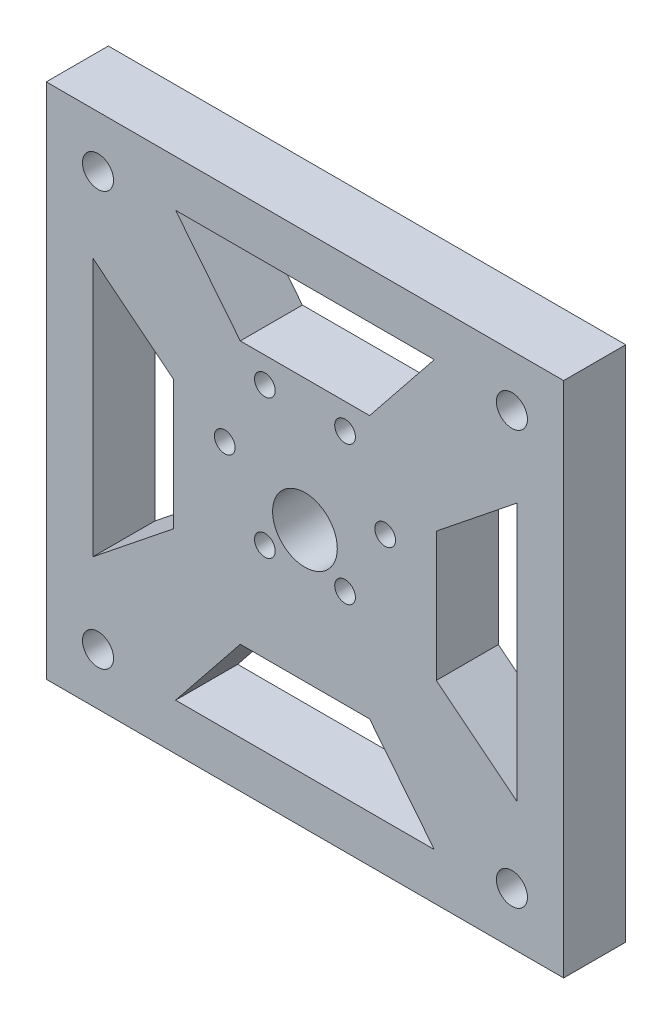
ISO-10303-21;
HEADER;
FILE_DESCRIPTION(('STEP AP214'),'2;1');
FILE_NAME('part.step','',(''),(''),'','','');
FILE_SCHEMA(('AUTOMOTIVE_DESIGN { 1 0 10303 214 1 1 1 1 }'));
ENDSEC;
DATA;
#1=APPLICATION_CONTEXT('core data for automotive mechanical design processes');
#2=APPLICATION_PROTOCOL_DEFINITION('international standard','automotive_design',2000,#1);
#3=PRODUCT_CONTEXT('',#1,'mechanical');
#4=PRODUCT('Part','Part','',(#3));
#5=PRODUCT_RELATED_PRODUCT_CATEGORY('part','',(#4));
#6=PRODUCT_DEFINITION_FORMATION('','',#4);
#7=PRODUCT_DEFINITION_CONTEXT('part definition',#1,'design');
#8=PRODUCT_DEFINITION('design','',#6,#7);
#9=PRODUCT_DEFINITION_SHAPE('','',#8);
#10=(LENGTH_UNIT() NAMED_UNIT(*) SI_UNIT(.MILLI.,.METRE.));
#11=(NAMED_UNIT(*) PLANE_ANGLE_UNIT() SI_UNIT($,.RADIAN.));
#12=(NAMED_UNIT(*) SI_UNIT($,.STERADIAN.) SOLID_ANGLE_UNIT());
#13=UNCERTAINTY_MEASURE_WITH_UNIT(LENGTH_MEASURE(1.E-05),#10,'distance_accuracy_value','');
#14=(GEOMETRIC_REPRESENTATION_CONTEXT(3) GLOBAL_UNCERTAINTY_ASSIGNED_CONTEXT((#13)) GLOBAL_UNIT_ASSIGNED_CONTEXT((#10,
#11,#12)) REPRESENTATION_CONTEXT('',''));
#15=CARTESIAN_POINT('',(0.,0.,0.));
#16=DIRECTION('',(0.,0.,1.));
#17=DIRECTION('',(1.,0.,0.));
#18=AXIS2_PLACEMENT_3D('',#15,#16,#17);
#19=CARTESIAN_POINT('',(0.,0.,12.));
#20=DIRECTION('',(0.,0.,1.));
#21=DIRECTION('',(1.,0.,0.));
#22=AXIS2_PLACEMENT_3D('',#19,#20,#21);
#23=PLANE('',#22);
#24=DIRECTION('',(-0.7806247497998,0.625,0.));
#25=VECTOR('',#24,1.);
#26=CARTESIAN_POINT('',(-25.387505004004,5.5,12.));
#27=LINE('',#26,#25);
#28=CARTESIAN_POINT('',(-25.387505004004,5.5,12.));
#29=VERTEX_POINT('',#28);
#30=CARTESIAN_POINT('',(-41.,18.,12.));
#31=VERTEX_POINT('',#30);
#32=EDGE_CURVE('E64',#29,#31,#27,.T.);
#33=ORIENTED_EDGE('',*,*,#32,.F.);
#34=DIRECTION('',(0.,1.,0.));
#35=VECTOR('',#34,1.);
#36=CARTESIAN_POINT('',(-25.387505004004,-19.5,12.));
#37=LINE('',#36,#35);
#38=CARTESIAN_POINT('',(-25.387505004004,-19.5,12.));
#39=VERTEX_POINT('',#38);
#40=EDGE_CURVE('E206',#39,#29,#37,.T.);
#41=ORIENTED_EDGE('',*,*,#40,.F.);
#42=DIRECTION('',(0.780624749799799,0.625,0.));
#43=VECTOR('',#42,1.);
#44=CARTESIAN_POINT('',(-41.,-32.,12.));
#45=LINE('',#44,#43);
#46=CARTESIAN_POINT('',(-41.,-32.,12.));
#47=VERTEX_POINT('',#46);
#48=EDGE_CURVE('E209',#47,#39,#45,.T.);
#49=ORIENTED_EDGE('',*,*,#48,.F.);
#50=DIRECTION('',(0.,-1.,0.));
#51=VECTOR('',#50,1.);
#52=CARTESIAN_POINT('',(-41.,18.,12.));
#53=LINE('',#52,#51);
#54=EDGE_CURVE('E215',#31,#47,#53,.T.);
#55=ORIENTED_EDGE('',*,*,#54,.F.);
#56=EDGE_LOOP('',(#33,#41,#49,#55));
#57=FACE_BOUND('',#56,.T.);
#58=DIRECTION('',(-1.,0.,0.));
#59=VECTOR('',#58,1.);
#60=CARTESIAN_POINT('',(25.,34.,12.));
#61=LINE('',#60,#59);
#62=CARTESIAN_POINT('',(25.,34.,12.));
#63=VERTEX_POINT('',#62);
#64=CARTESIAN_POINT('',(-25.,34.,12.));
#65=VERTEX_POINT('',#64);
#66=EDGE_CURVE('E72',#63,#65,#61,.T.);
#67=ORIENTED_EDGE('',*,*,#66,.F.);
#68=DIRECTION('',(0.625,0.7806247497998,0.));
#69=VECTOR('',#68,1.);
#70=CARTESIAN_POINT('',(12.5,18.387505004004,12.));
#71=LINE('',#70,#69);
#72=CARTESIAN_POINT('',(12.5,18.387505004004,12.));
#73=VERTEX_POINT('',#72);
#74=EDGE_CURVE('E230',#73,#63,#71,.T.);
#75=ORIENTED_EDGE('',*,*,#74,.F.);
#76=DIRECTION('',(1.,0.,0.));
#77=VECTOR('',#76,1.);
#78=CARTESIAN_POINT('',(-12.5,18.387505004004,12.));
#79=LINE('',#78,#77);
#80=CARTESIAN_POINT('',(-12.5,18.387505004004,12.));
#81=VERTEX_POINT('',#80);
#82=EDGE_CURVE('E245',#81,#73,#79,.T.);
#83=ORIENTED_EDGE('',*,*,#82,.F.);
#84=DIRECTION('',(0.625000000000001,-0.780624749799799,0.));
#85=VECTOR('',#84,1.);
#86=CARTESIAN_POINT('',(-25.,34.,12.));
#87=LINE('',#86,#85);
#88=EDGE_CURVE('E241',#65,#81,#87,.T.);
#89=ORIENTED_EDGE('',*,*,#88,.F.);
#90=EDGE_LOOP('',(#67,#75,#83,#89));
#91=FACE_BOUND('',#90,.T.);
#92=DIRECTION('',(0.,1.,0.));
#93=VECTOR('',#92,1.);
#94=CARTESIAN_POINT('',(41.,-32.,12.));
#95=LINE('',#94,#93);
#96=CARTESIAN_POINT('',(41.,-32.,12.));
#97=VERTEX_POINT('',#96);
#98=CARTESIAN_POINT('',(41.,18.,12.));
#99=VERTEX_POINT('',#98);
#100=EDGE_CURVE('E270',#97,#99,#95,.T.);
#101=ORIENTED_EDGE('',*,*,#100,.F.);
#102=DIRECTION('',(0.7806247497998,-0.625,0.));
#103=VECTOR('',#102,1.);
#104=CARTESIAN_POINT('',(25.387505004004,-19.5,12.));
#105=LINE('',#104,#103);
#106=CARTESIAN_POINT('',(25.387505004004,-19.5,12.));
#107=VERTEX_POINT('',#106);
#108=EDGE_CURVE('E260',#107,#97,#105,.T.);
#109=ORIENTED_EDGE('',*,*,#108,.F.);
#110=DIRECTION('',(0.,-1.,0.));
#111=VECTOR('',#110,1.);
#112=CARTESIAN_POINT('',(25.387505004004,5.5,12.));
#113=LINE('',#112,#111);
#114=CARTESIAN_POINT('',(25.387505004004,5.5,12.));
#115=VERTEX_POINT('',#114);
#116=EDGE_CURVE('E276',#115,#107,#113,.T.);
#117=ORIENTED_EDGE('',*,*,#116,.F.);
#118=DIRECTION('',(-0.780624749799799,-0.625,0.));
#119=VECTOR('',#118,1.);
#120=CARTESIAN_POINT('',(41.,18.,12.));
#121=LINE('',#120,#119);
#122=EDGE_CURVE('E272',#99,#115,#121,.T.);
#123=ORIENTED_EDGE('',*,*,#122,.F.);
#124=EDGE_LOOP('',(#101,#109,#117,#123));
#125=FACE_BOUND('',#124,.T.);
#126=DIRECTION('',(1.,0.,0.));
#127=VECTOR('',#126,1.);
#128=CARTESIAN_POINT('',(-25.,-48.,12.));
#129=LINE('',#128,#127);
#130=CARTESIAN_POINT('',(-25.,-48.,12.));
#131=VERTEX_POINT('',#130);
#132=CARTESIAN_POINT('',(25.,-48.,12.));
#133=VERTEX_POINT('',#132);
#134=EDGE_CURVE('E302',#131,#133,#129,.T.);
#135=ORIENTED_EDGE('',*,*,#134,.F.);
#136=DIRECTION('',(-0.625,-0.7806247497998,0.));
#137=VECTOR('',#136,1.);
#138=CARTESIAN_POINT('',(-12.5,-32.387505004004,12.));
#139=LINE('',#138,#137);
#140=CARTESIAN_POINT('',(-12.5,-32.387505004004,12.));
#141=VERTEX_POINT('',#140);
#142=EDGE_CURVE('E292',#141,#131,#139,.T.);
#143=ORIENTED_EDGE('',*,*,#142,.F.);
#144=DIRECTION('',(-1.,0.,0.));
#145=VECTOR('',#144,1.);
#146=CARTESIAN_POINT('',(12.5,-32.387505004004,12.));
#147=LINE('',#146,#145);
#148=CARTESIAN_POINT('',(12.5,-32.387505004004,12.));
#149=VERTEX_POINT('',#148);
#150=EDGE_CURVE('E307',#149,#141,#147,.T.);
#151=ORIENTED_EDGE('',*,*,#150,.F.);
#152=DIRECTION('',(-0.625,0.780624749799799,0.));
#153=VECTOR('',#152,1.);
#154=CARTESIAN_POINT('',(25.,-48.,12.));
#155=LINE('',#154,#153);
#156=EDGE_CURVE('E304',#133,#149,#155,.T.);
#157=ORIENTED_EDGE('',*,*,#156,.F.);
#158=EDGE_LOOP('',(#135,#143,#151,#157));
#159=FACE_BOUND('',#158,.T.);
#160=CARTESIAN_POINT('',(-39.9999999999992,-47.,12.));
#161=DIRECTION('',(0.,0.,1.));
#162=DIRECTION('',(1.,0.,0.));
#163=AXIS2_PLACEMENT_3D('',#160,#161,#162);
#164=CIRCLE('',#163,3.);
#165=CARTESIAN_POINT('',(-36.9999999999992,-47.,12.));
#166=VERTEX_POINT('',#165);
#167=EDGE_CURVE('E222',#166,#166,#164,.T.);
#168=ORIENTED_EDGE('',*,*,#167,.F.);
#169=EDGE_LOOP('',(#168));
#170=FACE_BOUND('',#169,.T.);
#171=CARTESIAN_POINT('',(40.0000000000008,-47.,12.));
#172=DIRECTION('',(0.,0.,1.));
#173=DIRECTION('',(1.,0.,0.));
#174=AXIS2_PLACEMENT_3D('',#171,#172,#173);
#175=CIRCLE('',#174,3.);
#176=CARTESIAN_POINT('',(43.0000000000008,-47.,12.));
#177=VERTEX_POINT('',#176);
#178=EDGE_CURVE('E329',#177,#177,#175,.T.);
#179=ORIENTED_EDGE('',*,*,#178,.F.);
#180=EDGE_LOOP('',(#179));
#181=FACE_BOUND('',#180,.T.);
#182=CARTESIAN_POINT('',(40.,33.,12.));
#183=DIRECTION('',(0.,0.,1.));
#184=DIRECTION('',(1.,0.,0.));
#185=AXIS2_PLACEMENT_3D('',#182,#183,#184);
#186=CIRCLE('',#185,3.);
#187=CARTESIAN_POINT('',(43.,33.,12.));
#188=VERTEX_POINT('',#187);
#189=EDGE_CURVE('E323',#188,#188,#186,.T.);
#190=ORIENTED_EDGE('',*,*,#189,.F.);
#191=EDGE_LOOP('',(#190));
#192=FACE_BOUND('',#191,.T.);
#193=CARTESIAN_POINT('',(-40.,33.,12.));
#194=DIRECTION('',(0.,0.,1.));
#195=DIRECTION('',(1.,0.,0.));
#196=AXIS2_PLACEMENT_3D('',#193,#194,#195);
#197=CIRCLE('',#196,3.);
#198=CARTESIAN_POINT('',(-37.,33.,12.));
#199=VERTEX_POINT('',#198);
#200=EDGE_CURVE('E322',#199,#199,#197,.T.);
#201=ORIENTED_EDGE('',*,*,#200,.F.);
#202=EDGE_LOOP('',(#201));
#203=FACE_BOUND('',#202,.T.);
#204=CARTESIAN_POINT('',(0.,-7.,12.));
#205=DIRECTION('',(0.,0.,1.));
#206=DIRECTION('',(1.,0.,0.));
#207=AXIS2_PLACEMENT_3D('',#204,#205,#206);
#208=CIRCLE('',#207,6.25);
#209=CARTESIAN_POINT('',(6.25,-7.,12.));
#210=VERTEX_POINT('',#209);
#211=EDGE_CURVE('E372',#210,#210,#208,.T.);
#212=ORIENTED_EDGE('',*,*,#211,.F.);
#213=EDGE_LOOP('',(#212));
#214=FACE_BOUND('',#213,.T.);
#215=CARTESIAN_POINT('',(-15.5,0.,12.));
#216=DIRECTION('',(0.,0.,1.));
#217=DIRECTION('',(1.,0.,0.));
#218=AXIS2_PLACEMENT_3D('',#215,#216,#217);
#219=CIRCLE('',#218,2.);
#220=CARTESIAN_POINT('',(-13.5,0.,12.));
#221=VERTEX_POINT('',#220);
#222=EDGE_CURVE('E376',#221,#221,#219,.T.);
#223=ORIENTED_EDGE('',*,*,#222,.F.);
#224=EDGE_LOOP('',(#223));
#225=FACE_BOUND('',#224,.T.);
#226=CARTESIAN_POINT('',(-7.75000000000006,-13.4233937586588,12.));
#227=DIRECTION('',(0.,0.,1.));
#228=DIRECTION('',(1.,0.,0.));
#229=AXIS2_PLACEMENT_3D('',#226,#227,#228);
#230=CIRCLE('',#229,2.);
#231=CARTESIAN_POINT('',(-5.75000000000006,-13.4233937586588,12.));
#232=VERTEX_POINT('',#231);
#233=EDGE_CURVE('E400',#232,#232,#230,.T.);
#234=ORIENTED_EDGE('',*,*,#233,.F.);
#235=EDGE_LOOP('',(#234));
#236=FACE_BOUND('',#235,.T.);
#237=CARTESIAN_POINT('',(7.74999999999997,-13.4233937586588,12.));
#238=DIRECTION('',(0.,0.,1.));
#239=DIRECTION('',(1.,0.,0.));
#240=AXIS2_PLACEMENT_3D('',#237,#238,#239);
#241=CIRCLE('',#240,2.);
#242=CARTESIAN_POINT('',(9.74999999999997,-13.4233937586588,12.));
#243=VERTEX_POINT('',#242);
#244=EDGE_CURVE('E394',#243,#243,#241,.T.);
#245=ORIENTED_EDGE('',*,*,#244,.F.);
#246=EDGE_LOOP('',(#245));
#247=FACE_BOUND('',#246,.T.);
#248=CARTESIAN_POINT('',(15.5,0.,12.));
#249=DIRECTION('',(0.,0.,1.));
#250=DIRECTION('',(1.,0.,0.));
#251=AXIS2_PLACEMENT_3D('',#248,#249,#250);
#252=CIRCLE('',#251,2.);
#253=CARTESIAN_POINT('',(17.5,0.,12.));
#254=VERTEX_POINT('',#253);
#255=EDGE_CURVE('E388',#254,#254,#252,.T.);
#256=ORIENTED_EDGE('',*,*,#255,.F.);
#257=EDGE_LOOP('',(#256));
#258=FACE_BOUND('',#257,.T.);
#259=CARTESIAN_POINT('',(7.75000000000016,13.4233937586587,12.));
#260=DIRECTION('',(0.,0.,1.));
#261=DIRECTION('',(1.,0.,0.));
#262=AXIS2_PLACEMENT_3D('',#259,#260,#261);
#263=CIRCLE('',#262,2.);
#264=CARTESIAN_POINT('',(9.75000000000016,13.4233937586587,12.));
#265=VERTEX_POINT('',#264);
#266=EDGE_CURVE('E382',#265,#265,#263,.T.);
#267=ORIENTED_EDGE('',*,*,#266,.F.);
#268=EDGE_LOOP('',(#267));
#269=FACE_BOUND('',#268,.T.);
#270=CARTESIAN_POINT('',(-7.74999999999987,13.4233937586589,12.));
#271=DIRECTION('',(0.,0.,1.));
#272=DIRECTION('',(1.,0.,0.));
#273=AXIS2_PLACEMENT_3D('',#270,#271,#272);
#274=CIRCLE('',#273,2.);
#275=CARTESIAN_POINT('',(-5.74999999999987,13.4233937586589,12.));
#276=VERTEX_POINT('',#275);
#277=EDGE_CURVE('E53',#276,#276,#274,.T.);
#278=ORIENTED_EDGE('',*,*,#277,.F.);
#279=EDGE_LOOP('',(#278));
#280=FACE_BOUND('',#279,.T.);
#281=DIRECTION('',(-1.,0.,0.));
#282=VECTOR('',#281,1.);
#283=CARTESIAN_POINT('',(50.,-57.,12.));
#284=LINE('',#283,#282);
#285=CARTESIAN_POINT('',(50.,-57.,12.));
#286=VERTEX_POINT('',#285);
#287=CARTESIAN_POINT('',(-50.,-57.,12.));
#288=VERTEX_POINT('',#287);
#289=EDGE_CURVE('E340',#286,#288,#284,.T.);
#290=ORIENTED_EDGE('',*,*,#289,.F.);
#291=DIRECTION('',(0.,-1.,0.));
#292=VECTOR('',#291,1.);
#293=CARTESIAN_POINT('',(50.,43.,12.));
#294=LINE('',#293,#292);
#295=CARTESIAN_POINT('',(50.,43.,12.));
#296=VERTEX_POINT('',#295);
#297=EDGE_CURVE('E346',#296,#286,#294,.T.);
#298=ORIENTED_EDGE('',*,*,#297,.F.);
#299=DIRECTION('',(-1.,0.,0.));
#300=VECTOR('',#299,1.);
#301=CARTESIAN_POINT('',(50.,43.,12.));
#302=LINE('',#301,#300);
#303=CARTESIAN_POINT('',(-50.,43.,12.));
#304=VERTEX_POINT('',#303);
#305=EDGE_CURVE('E360',#296,#304,#302,.T.);
#306=ORIENTED_EDGE('',*,*,#305,.T.);
#307=DIRECTION('',(0.,-1.,0.));
#308=VECTOR('',#307,1.);
#309=CARTESIAN_POINT('',(-50.,43.,12.));
#310=LINE('',#309,#308);
#311=EDGE_CURVE('E357',#304,#288,#310,.T.);
#312=ORIENTED_EDGE('',*,*,#311,.T.);
#313=EDGE_LOOP('',(#290,#298,#306,#312));
#314=FACE_BOUND('',#313,.T.);
#315=ADVANCED_FACE('F49',(#57,#91,#125,#159,#170,#181,#192,#203,#214,#225,#236,#247,#258,#269,
#280,#314),#23,.T.);
#316=CARTESIAN_POINT('',(0.,0.,0.));
#317=DIRECTION('',(0.,0.,1.));
#318=DIRECTION('',(1.,0.,0.));
#319=AXIS2_PLACEMENT_3D('',#316,#317,#318);
#320=PLANE('',#319);
#321=DIRECTION('',(0.,1.,0.));
#322=VECTOR('',#321,1.);
#323=CARTESIAN_POINT('',(-25.387505004004,-19.5,0.));
#324=LINE('',#323,#322);
#325=CARTESIAN_POINT('',(-25.387505004004,-19.5,0.));
#326=VERTEX_POINT('',#325);
#327=CARTESIAN_POINT('',(-25.387505004004,5.5,0.));
#328=VERTEX_POINT('',#327);
#329=EDGE_CURVE('E194',#326,#328,#324,.T.);
#330=ORIENTED_EDGE('',*,*,#329,.T.);
#331=DIRECTION('',(-0.7806247497998,0.625,0.));
#332=VECTOR('',#331,1.);
#333=CARTESIAN_POINT('',(-25.387505004004,5.5,0.));
#334=LINE('',#333,#332);
#335=CARTESIAN_POINT('',(-41.,18.,0.));
#336=VERTEX_POINT('',#335);
#337=EDGE_CURVE('E188',#328,#336,#334,.T.);
#338=ORIENTED_EDGE('',*,*,#337,.T.);
#339=DIRECTION('',(0.,-1.,0.));
#340=VECTOR('',#339,1.);
#341=CARTESIAN_POINT('',(-41.,18.,0.));
#342=LINE('',#341,#340);
#343=CARTESIAN_POINT('',(-41.,-32.,0.));
#344=VERTEX_POINT('',#343);
#345=EDGE_CURVE('E198',#336,#344,#342,.T.);
#346=ORIENTED_EDGE('',*,*,#345,.T.);
#347=DIRECTION('',(0.780624749799799,0.625,0.));
#348=VECTOR('',#347,1.);
#349=CARTESIAN_POINT('',(-41.,-32.,0.));
#350=LINE('',#349,#348);
#351=EDGE_CURVE('E202',#344,#326,#350,.T.);
#352=ORIENTED_EDGE('',*,*,#351,.T.);
#353=EDGE_LOOP('',(#330,#338,#346,#352));
#354=FACE_BOUND('',#353,.T.);
#355=DIRECTION('',(0.625,0.7806247497998,0.));
#356=VECTOR('',#355,1.);
#357=CARTESIAN_POINT('',(12.5,18.387505004004,0.));
#358=LINE('',#357,#356);
#359=CARTESIAN_POINT('',(12.5,18.387505004004,0.));
#360=VERTEX_POINT('',#359);
#361=CARTESIAN_POINT('',(25.,34.,0.));
#362=VERTEX_POINT('',#361);
#363=EDGE_CURVE('E236',#360,#362,#358,.T.);
#364=ORIENTED_EDGE('',*,*,#363,.T.);
#365=DIRECTION('',(-1.,0.,0.));
#366=VECTOR('',#365,1.);
#367=CARTESIAN_POINT('',(25.,34.,0.));
#368=LINE('',#367,#366);
#369=CARTESIAN_POINT('',(-25.,34.,0.));
#370=VERTEX_POINT('',#369);
#371=EDGE_CURVE('E226',#362,#370,#368,.T.);
#372=ORIENTED_EDGE('',*,*,#371,.T.);
#373=DIRECTION('',(0.625000000000001,-0.780624749799799,0.));
#374=VECTOR('',#373,1.);
#375=CARTESIAN_POINT('',(-25.,34.,0.));
#376=LINE('',#375,#374);
#377=CARTESIAN_POINT('',(-12.5,18.387505004004,0.));
#378=VERTEX_POINT('',#377);
#379=EDGE_CURVE('E229',#370,#378,#376,.T.);
#380=ORIENTED_EDGE('',*,*,#379,.T.);
#381=DIRECTION('',(1.,0.,0.));
#382=VECTOR('',#381,1.);
#383=CARTESIAN_POINT('',(-12.5,18.387505004004,0.));
#384=LINE('',#383,#382);
#385=EDGE_CURVE('E233',#378,#360,#384,.T.);
#386=ORIENTED_EDGE('',*,*,#385,.T.);
#387=EDGE_LOOP('',(#364,#372,#380,#386));
#388=FACE_BOUND('',#387,.T.);
#389=DIRECTION('',(0.7806247497998,-0.625,0.));
#390=VECTOR('',#389,1.);
#391=CARTESIAN_POINT('',(25.387505004004,-19.5,0.));
#392=LINE('',#391,#390);
#393=CARTESIAN_POINT('',(25.387505004004,-19.5,0.));
#394=VERTEX_POINT('',#393);
#395=CARTESIAN_POINT('',(41.,-32.,0.));
#396=VERTEX_POINT('',#395);
#397=EDGE_CURVE('E266',#394,#396,#392,.T.);
#398=ORIENTED_EDGE('',*,*,#397,.T.);
#399=DIRECTION('',(0.,1.,0.));
#400=VECTOR('',#399,1.);
#401=CARTESIAN_POINT('',(41.,-32.,0.));
#402=LINE('',#401,#400);
#403=CARTESIAN_POINT('',(41.,18.,0.));
#404=VERTEX_POINT('',#403);
#405=EDGE_CURVE('E256',#396,#404,#402,.T.);
#406=ORIENTED_EDGE('',*,*,#405,.T.);
#407=DIRECTION('',(-0.780624749799799,-0.625,0.));
#408=VECTOR('',#407,1.);
#409=CARTESIAN_POINT('',(41.,18.,0.));
#410=LINE('',#409,#408);
#411=CARTESIAN_POINT('',(25.387505004004,5.5,0.));
#412=VERTEX_POINT('',#411);
#413=EDGE_CURVE('E259',#404,#412,#410,.T.);
#414=ORIENTED_EDGE('',*,*,#413,.T.);
#415=DIRECTION('',(0.,-1.,0.));
#416=VECTOR('',#415,1.);
#417=CARTESIAN_POINT('',(25.387505004004,5.5,0.));
#418=LINE('',#417,#416);
#419=EDGE_CURVE('E263',#412,#394,#418,.T.);
#420=ORIENTED_EDGE('',*,*,#419,.T.);
#421=EDGE_LOOP('',(#398,#406,#414,#420));
#422=FACE_BOUND('',#421,.T.);
#423=DIRECTION('',(-0.625,-0.7806247497998,0.));
#424=VECTOR('',#423,1.);
#425=CARTESIAN_POINT('',(-12.5,-32.387505004004,0.));
#426=LINE('',#425,#424);
#427=CARTESIAN_POINT('',(-12.5,-32.387505004004,0.));
#428=VERTEX_POINT('',#427);
#429=CARTESIAN_POINT('',(-25.,-48.,0.));
#430=VERTEX_POINT('',#429);
#431=EDGE_CURVE('E298',#428,#430,#426,.T.);
#432=ORIENTED_EDGE('',*,*,#431,.T.);
#433=DIRECTION('',(1.,0.,0.));
#434=VECTOR('',#433,1.);
#435=CARTESIAN_POINT('',(-25.,-48.,0.));
#436=LINE('',#435,#434);
#437=CARTESIAN_POINT('',(25.,-48.,0.));
#438=VERTEX_POINT('',#437);
#439=EDGE_CURVE('E288',#430,#438,#436,.T.);
#440=ORIENTED_EDGE('',*,*,#439,.T.);
#441=DIRECTION('',(-0.625,0.780624749799799,0.));
#442=VECTOR('',#441,1.);
#443=CARTESIAN_POINT('',(25.,-48.,0.));
#444=LINE('',#443,#442);
#445=CARTESIAN_POINT('',(12.5,-32.387505004004,0.));
#446=VERTEX_POINT('',#445);
#447=EDGE_CURVE('E291',#438,#446,#444,.T.);
#448=ORIENTED_EDGE('',*,*,#447,.T.);
#449=DIRECTION('',(-1.,0.,0.));
#450=VECTOR('',#449,1.);
#451=CARTESIAN_POINT('',(12.5,-32.387505004004,0.));
#452=LINE('',#451,#450);
#453=EDGE_CURVE('E295',#446,#428,#452,.T.);
#454=ORIENTED_EDGE('',*,*,#453,.T.);
#455=EDGE_LOOP('',(#432,#440,#448,#454));
#456=FACE_BOUND('',#455,.T.);
#457=CARTESIAN_POINT('',(-39.9999999999992,-47.,0.));
#458=DIRECTION('',(0.,0.,1.));
#459=DIRECTION('',(1.,0.,0.));
#460=AXIS2_PLACEMENT_3D('',#457,#458,#459);
#461=CIRCLE('',#460,3.);
#462=CARTESIAN_POINT('',(-36.9999999999992,-47.,0.));
#463=VERTEX_POINT('',#462);
#464=EDGE_CURVE('E332',#463,#463,#461,.T.);
#465=ORIENTED_EDGE('',*,*,#464,.T.);
#466=EDGE_LOOP('',(#465));
#467=FACE_BOUND('',#466,.T.);
#468=CARTESIAN_POINT('',(40.0000000000008,-47.,0.));
#469=DIRECTION('',(0.,0.,1.));
#470=DIRECTION('',(1.,0.,0.));
#471=AXIS2_PLACEMENT_3D('',#468,#469,#470);
#472=CIRCLE('',#471,3.);
#473=CARTESIAN_POINT('',(43.0000000000008,-47.,0.));
#474=VERTEX_POINT('',#473);
#475=EDGE_CURVE('E326',#474,#474,#472,.T.);
#476=ORIENTED_EDGE('',*,*,#475,.T.);
#477=EDGE_LOOP('',(#476));
#478=FACE_BOUND('',#477,.T.);
#479=CARTESIAN_POINT('',(40.,33.,0.));
#480=DIRECTION('',(0.,0.,1.));
#481=DIRECTION('',(1.,0.,0.));
#482=AXIS2_PLACEMENT_3D('',#479,#480,#481);
#483=CIRCLE('',#482,3.);
#484=CARTESIAN_POINT('',(43.,33.,0.));
#485=VERTEX_POINT('',#484);
#486=EDGE_CURVE('E319',#485,#485,#483,.T.);
#487=ORIENTED_EDGE('',*,*,#486,.T.);
#488=EDGE_LOOP('',(#487));
#489=FACE_BOUND('',#488,.T.);
#490=CARTESIAN_POINT('',(-40.,33.,0.));
#491=DIRECTION('',(0.,0.,1.));
#492=DIRECTION('',(1.,0.,0.));
#493=AXIS2_PLACEMENT_3D('',#490,#491,#492);
#494=CIRCLE('',#493,3.);
#495=CARTESIAN_POINT('',(-37.,33.,0.));
#496=VERTEX_POINT('',#495);
#497=EDGE_CURVE('E337',#496,#496,#494,.T.);
#498=ORIENTED_EDGE('',*,*,#497,.T.);
#499=EDGE_LOOP('',(#498));
#500=FACE_BOUND('',#499,.T.);
#501=CARTESIAN_POINT('',(0.,-7.,0.));
#502=DIRECTION('',(0.,0.,1.));
#503=DIRECTION('',(1.,0.,0.));
#504=AXIS2_PLACEMENT_3D('',#501,#502,#503);
#505=CIRCLE('',#504,6.25);
#506=CARTESIAN_POINT('',(6.25,-7.,0.));
#507=VERTEX_POINT('',#506);
#508=EDGE_CURVE('E373',#507,#507,#505,.T.);
#509=ORIENTED_EDGE('',*,*,#508,.T.);
#510=EDGE_LOOP('',(#509));
#511=FACE_BOUND('',#510,.T.);
#512=CARTESIAN_POINT('',(-15.5,0.,0.));
#513=DIRECTION('',(0.,0.,1.));
#514=DIRECTION('',(1.,0.,0.));
#515=AXIS2_PLACEMENT_3D('',#512,#513,#514);
#516=CIRCLE('',#515,2.);
#517=CARTESIAN_POINT('',(-13.5,0.,0.));
#518=VERTEX_POINT('',#517);
#519=EDGE_CURVE('E403',#518,#518,#516,.T.);
#520=ORIENTED_EDGE('',*,*,#519,.T.);
#521=EDGE_LOOP('',(#520));
#522=FACE_BOUND('',#521,.T.);
#523=CARTESIAN_POINT('',(-7.75000000000006,-13.4233937586588,0.));
#524=DIRECTION('',(0.,0.,1.));
#525=DIRECTION('',(1.,0.,0.));
#526=AXIS2_PLACEMENT_3D('',#523,#524,#525);
#527=CIRCLE('',#526,2.);
#528=CARTESIAN_POINT('',(-5.75000000000006,-13.4233937586588,0.));
#529=VERTEX_POINT('',#528);
#530=EDGE_CURVE('E397',#529,#529,#527,.T.);
#531=ORIENTED_EDGE('',*,*,#530,.T.);
#532=EDGE_LOOP('',(#531));
#533=FACE_BOUND('',#532,.T.);
#534=CARTESIAN_POINT('',(7.74999999999997,-13.4233937586588,0.));
#535=DIRECTION('',(0.,0.,1.));
#536=DIRECTION('',(1.,0.,0.));
#537=AXIS2_PLACEMENT_3D('',#534,#535,#536);
#538=CIRCLE('',#537,2.);
#539=CARTESIAN_POINT('',(9.74999999999997,-13.4233937586588,0.));
#540=VERTEX_POINT('',#539);
#541=EDGE_CURVE('E391',#540,#540,#538,.T.);
#542=ORIENTED_EDGE('',*,*,#541,.T.);
#543=EDGE_LOOP('',(#542));
#544=FACE_BOUND('',#543,.T.);
#545=CARTESIAN_POINT('',(15.5,0.,0.));
#546=DIRECTION('',(0.,0.,1.));
#547=DIRECTION('',(1.,0.,0.));
#548=AXIS2_PLACEMENT_3D('',#545,#546,#547);
#549=CIRCLE('',#548,2.);
#550=CARTESIAN_POINT('',(17.5,0.,0.));
#551=VERTEX_POINT('',#550);
#552=EDGE_CURVE('E385',#551,#551,#549,.T.);
#553=ORIENTED_EDGE('',*,*,#552,.T.);
#554=EDGE_LOOP('',(#553));
#555=FACE_BOUND('',#554,.T.);
#556=CARTESIAN_POINT('',(7.75000000000016,13.4233937586587,0.));
#557=DIRECTION('',(0.,0.,1.));
#558=DIRECTION('',(1.,0.,0.));
#559=AXIS2_PLACEMENT_3D('',#556,#557,#558);
#560=CIRCLE('',#559,2.);
#561=CARTESIAN_POINT('',(9.75000000000016,13.4233937586587,0.));
#562=VERTEX_POINT('',#561);
#563=EDGE_CURVE('E379',#562,#562,#560,.T.);
#564=ORIENTED_EDGE('',*,*,#563,.T.);
#565=EDGE_LOOP('',(#564));
#566=FACE_BOUND('',#565,.T.);
#567=CARTESIAN_POINT('',(-7.74999999999987,13.4233937586589,0.));
#568=DIRECTION('',(0.,0.,1.));
#569=DIRECTION('',(1.,0.,0.));
#570=AXIS2_PLACEMENT_3D('',#567,#568,#569);
#571=CIRCLE('',#570,2.);
#572=CARTESIAN_POINT('',(-5.74999999999987,13.4233937586589,0.));
#573=VERTEX_POINT('',#572);
#574=EDGE_CURVE('E12',#573,#573,#571,.T.);
#575=ORIENTED_EDGE('',*,*,#574,.T.);
#576=EDGE_LOOP('',(#575));
#577=FACE_BOUND('',#576,.T.);
#578=DIRECTION('',(-1.,0.,0.));
#579=VECTOR('',#578,1.);
#580=CARTESIAN_POINT('',(50.,-57.,0.));
#581=LINE('',#580,#579);
#582=CARTESIAN_POINT('',(50.,-57.,0.));
#583=VERTEX_POINT('',#582);
#584=CARTESIAN_POINT('',(-50.,-57.,0.));
#585=VERTEX_POINT('',#584);
#586=EDGE_CURVE('E343',#583,#585,#581,.T.);
#587=ORIENTED_EDGE('',*,*,#586,.T.);
#588=DIRECTION('',(0.,-1.,0.));
#589=VECTOR('',#588,1.);
#590=CARTESIAN_POINT('',(-50.,43.,0.));
#591=LINE('',#590,#589);
#592=CARTESIAN_POINT('',(-50.,43.,0.));
#593=VERTEX_POINT('',#592);
#594=EDGE_CURVE('E345',#593,#585,#591,.T.);
#595=ORIENTED_EDGE('',*,*,#594,.F.);
#596=DIRECTION('',(-1.,0.,0.));
#597=VECTOR('',#596,1.);
#598=CARTESIAN_POINT('',(50.,43.,0.));
#599=LINE('',#598,#597);
#600=CARTESIAN_POINT('',(50.,43.,0.));
#601=VERTEX_POINT('',#600);
#602=EDGE_CURVE('E349',#601,#593,#599,.T.);
#603=ORIENTED_EDGE('',*,*,#602,.F.);
#604=DIRECTION('',(0.,-1.,0.));
#605=VECTOR('',#604,1.);
#606=CARTESIAN_POINT('',(50.,43.,0.));
#607=LINE('',#606,#605);
#608=EDGE_CURVE('E352',#601,#583,#607,.T.);
#609=ORIENTED_EDGE('',*,*,#608,.T.);
#610=EDGE_LOOP('',(#587,#595,#603,#609));
#611=FACE_BOUND('',#610,.T.);
#612=ADVANCED_FACE('F51',(#354,#388,#422,#456,#467,#478,#489,#500,#511,#522,#533,#544,#555,#566,
#577,#611),#320,.F.);
#613=CARTESIAN_POINT('',(-7.74999999999987,13.4233937586589,0.));
#614=DIRECTION('',(0.,0.,1.));
#615=DIRECTION('',(1.,0.,0.));
#616=AXIS2_PLACEMENT_3D('',#613,#614,#615);
#617=CYLINDRICAL_SURFACE('',#616,2.);
#618=ORIENTED_EDGE('',*,*,#574,.F.);
#619=EDGE_LOOP('',(#618));
#620=FACE_BOUND('',#619,.T.);
#621=ORIENTED_EDGE('',*,*,#277,.T.);
#622=EDGE_LOOP('',(#621));
#623=FACE_BOUND('',#622,.T.);
#624=ADVANCED_FACE('F445',(#620,#623),#617,.F.);
#625=CARTESIAN_POINT('',(7.75000000000016,13.4233937586587,0.));
#626=DIRECTION('',(0.,0.,1.));
#627=DIRECTION('',(1.,0.,0.));
#628=AXIS2_PLACEMENT_3D('',#625,#626,#627);
#629=CYLINDRICAL_SURFACE('',#628,2.);
#630=ORIENTED_EDGE('',*,*,#563,.F.);
#631=EDGE_LOOP('',(#630));
#632=FACE_BOUND('',#631,.T.);
#633=ORIENTED_EDGE('',*,*,#266,.T.);
#634=EDGE_LOOP('',(#633));
#635=FACE_BOUND('',#634,.T.);
#636=ADVANCED_FACE('F449',(#632,#635),#629,.F.);
#637=CARTESIAN_POINT('',(15.5,0.,0.));
#638=DIRECTION('',(0.,0.,1.));
#639=DIRECTION('',(1.,0.,0.));
#640=AXIS2_PLACEMENT_3D('',#637,#638,#639);
#641=CYLINDRICAL_SURFACE('',#640,2.);
#642=ORIENTED_EDGE('',*,*,#552,.F.);
#643=EDGE_LOOP('',(#642));
#644=FACE_BOUND('',#643,.T.);
#645=ORIENTED_EDGE('',*,*,#255,.T.);
#646=EDGE_LOOP('',(#645));
#647=FACE_BOUND('',#646,.T.);
#648=ADVANCED_FACE('F455',(#644,#647),#641,.F.);
#649=CARTESIAN_POINT('',(7.74999999999997,-13.4233937586588,0.));
#650=DIRECTION('',(0.,0.,1.));
#651=DIRECTION('',(1.,0.,0.));
#652=AXIS2_PLACEMENT_3D('',#649,#650,#651);
#653=CYLINDRICAL_SURFACE('',#652,2.);
#654=ORIENTED_EDGE('',*,*,#541,.F.);
#655=EDGE_LOOP('',(#654));
#656=FACE_BOUND('',#655,.T.);
#657=ORIENTED_EDGE('',*,*,#244,.T.);
#658=EDGE_LOOP('',(#657));
#659=FACE_BOUND('',#658,.T.);
#660=ADVANCED_FACE('F468',(#656,#659),#653,.F.);
#661=CARTESIAN_POINT('',(-7.75000000000006,-13.4233937586588,0.));
#662=DIRECTION('',(0.,0.,1.));
#663=DIRECTION('',(1.,0.,0.));
#664=AXIS2_PLACEMENT_3D('',#661,#662,#663);
#665=CYLINDRICAL_SURFACE('',#664,2.);
#666=ORIENTED_EDGE('',*,*,#530,.F.);
#667=EDGE_LOOP('',(#666));
#668=FACE_BOUND('',#667,.T.);
#669=ORIENTED_EDGE('',*,*,#233,.T.);
#670=EDGE_LOOP('',(#669));
#671=FACE_BOUND('',#670,.T.);
#672=ADVANCED_FACE('F464',(#668,#671),#665,.F.);
#673=CARTESIAN_POINT('',(-15.5,0.,0.));
#674=DIRECTION('',(0.,0.,1.));
#675=DIRECTION('',(1.,0.,0.));
#676=AXIS2_PLACEMENT_3D('',#673,#674,#675);
#677=CYLINDRICAL_SURFACE('',#676,2.);
#678=ORIENTED_EDGE('',*,*,#519,.F.);
#679=EDGE_LOOP('',(#678));
#680=FACE_BOUND('',#679,.T.);
#681=ORIENTED_EDGE('',*,*,#222,.T.);
#682=EDGE_LOOP('',(#681));
#683=FACE_BOUND('',#682,.T.);
#684=ADVANCED_FACE('F409',(#680,#683),#677,.F.);
#685=CARTESIAN_POINT('',(0.,-7.,0.));
#686=DIRECTION('',(0.,0.,1.));
#687=DIRECTION('',(1.,0.,0.));
#688=AXIS2_PLACEMENT_3D('',#685,#686,#687);
#689=CYLINDRICAL_SURFACE('',#688,6.25);
#690=ORIENTED_EDGE('',*,*,#508,.F.);
#691=EDGE_LOOP('',(#690));
#692=FACE_BOUND('',#691,.T.);
#693=ORIENTED_EDGE('',*,*,#211,.T.);
#694=EDGE_LOOP('',(#693));
#695=FACE_BOUND('',#694,.T.);
#696=ADVANCED_FACE('F463',(#692,#695),#689,.F.);
#697=CARTESIAN_POINT('',(50.,-57.,0.));
#698=DIRECTION('',(0.,1.,0.));
#699=DIRECTION('',(-1.,0.,0.));
#700=AXIS2_PLACEMENT_3D('',#697,#698,#699);
#701=PLANE('',#700);
#702=ORIENTED_EDGE('',*,*,#289,.T.);
#703=DIRECTION('',(0.,0.,1.));
#704=VECTOR('',#703,1.);
#705=CARTESIAN_POINT('',(-50.,-57.,0.));
#706=LINE('',#705,#704);
#707=EDGE_CURVE('E370',#585,#288,#706,.T.);
#708=ORIENTED_EDGE('',*,*,#707,.F.);
#709=ORIENTED_EDGE('',*,*,#586,.F.);
#710=DIRECTION('',(0.,0.,1.));
#711=VECTOR('',#710,1.);
#712=CARTESIAN_POINT('',(50.,-57.,0.));
#713=LINE('',#712,#711);
#714=EDGE_CURVE('E354',#583,#286,#713,.T.);
#715=ORIENTED_EDGE('',*,*,#714,.T.);
#716=EDGE_LOOP('',(#702,#708,#709,#715));
#717=FACE_BOUND('',#716,.T.);
#718=ADVANCED_FACE('F431',(#717),#701,.F.);
#719=CARTESIAN_POINT('',(-50.,43.,0.));
#720=DIRECTION('',(-1.,0.,0.));
#721=DIRECTION('',(0.,-1.,0.));
#722=AXIS2_PLACEMENT_3D('',#719,#720,#721);
#723=PLANE('',#722);
#724=ORIENTED_EDGE('',*,*,#311,.F.);
#725=DIRECTION('',(0.,0.,1.));
#726=VECTOR('',#725,1.);
#727=CARTESIAN_POINT('',(-50.,43.,0.));
#728=LINE('',#727,#726);
#729=EDGE_CURVE('E368',#593,#304,#728,.T.);
#730=ORIENTED_EDGE('',*,*,#729,.F.);
#731=ORIENTED_EDGE('',*,*,#594,.T.);
#732=ORIENTED_EDGE('',*,*,#707,.T.);
#733=EDGE_LOOP('',(#724,#730,#731,#732));
#734=FACE_BOUND('',#733,.T.);
#735=ADVANCED_FACE('F442',(#734),#723,.T.);
#736=CARTESIAN_POINT('',(50.,43.,0.));
#737=DIRECTION('',(0.,1.,0.));
#738=DIRECTION('',(-1.,0.,0.));
#739=AXIS2_PLACEMENT_3D('',#736,#737,#738);
#740=PLANE('',#739);
#741=ORIENTED_EDGE('',*,*,#305,.F.);
#742=DIRECTION('',(0.,0.,1.));
#743=VECTOR('',#742,1.);
#744=CARTESIAN_POINT('',(50.,43.,0.));
#745=LINE('',#744,#743);
#746=EDGE_CURVE('E366',#601,#296,#745,.T.);
#747=ORIENTED_EDGE('',*,*,#746,.F.);
#748=ORIENTED_EDGE('',*,*,#602,.T.);
#749=ORIENTED_EDGE('',*,*,#729,.T.);
#750=EDGE_LOOP('',(#741,#747,#748,#749));
#751=FACE_BOUND('',#750,.T.);
#752=ADVANCED_FACE('F439',(#751),#740,.T.);
#753=CARTESIAN_POINT('',(50.,43.,0.));
#754=DIRECTION('',(-1.,0.,0.));
#755=DIRECTION('',(0.,-1.,0.));
#756=AXIS2_PLACEMENT_3D('',#753,#754,#755);
#757=PLANE('',#756);
#758=ORIENTED_EDGE('',*,*,#297,.T.);
#759=ORIENTED_EDGE('',*,*,#714,.F.);
#760=ORIENTED_EDGE('',*,*,#608,.F.);
#761=ORIENTED_EDGE('',*,*,#746,.T.);
#762=EDGE_LOOP('',(#758,#759,#760,#761));
#763=FACE_BOUND('',#762,.T.);
#764=ADVANCED_FACE('F436',(#763),#757,.F.);
#765=CARTESIAN_POINT('',(-40.,33.,0.));
#766=DIRECTION('',(0.,0.,1.));
#767=DIRECTION('',(1.,0.,0.));
#768=AXIS2_PLACEMENT_3D('',#765,#766,#767);
#769=CYLINDRICAL_SURFACE('',#768,3.);
#770=ORIENTED_EDGE('',*,*,#497,.F.);
#771=EDGE_LOOP('',(#770));
#772=FACE_BOUND('',#771,.T.);
#773=ORIENTED_EDGE('',*,*,#200,.T.);
#774=EDGE_LOOP('',(#773));
#775=FACE_BOUND('',#774,.T.);
#776=ADVANCED_FACE('F487',(#772,#775),#769,.F.);
#777=CARTESIAN_POINT('',(40.,33.,0.));
#778=DIRECTION('',(0.,0.,1.));
#779=DIRECTION('',(1.,0.,0.));
#780=AXIS2_PLACEMENT_3D('',#777,#778,#779);
#781=CYLINDRICAL_SURFACE('',#780,3.);
#782=ORIENTED_EDGE('',*,*,#486,.F.);
#783=EDGE_LOOP('',(#782));
#784=FACE_BOUND('',#783,.T.);
#785=ORIENTED_EDGE('',*,*,#189,.T.);
#786=EDGE_LOOP('',(#785));
#787=FACE_BOUND('',#786,.T.);
#788=ADVANCED_FACE('F490',(#784,#787),#781,.F.);
#789=CARTESIAN_POINT('',(40.0000000000008,-47.,0.));
#790=DIRECTION('',(0.,0.,1.));
#791=DIRECTION('',(1.,0.,0.));
#792=AXIS2_PLACEMENT_3D('',#789,#790,#791);
#793=CYLINDRICAL_SURFACE('',#792,3.);
#794=ORIENTED_EDGE('',*,*,#475,.F.);
#795=EDGE_LOOP('',(#794));
#796=FACE_BOUND('',#795,.T.);
#797=ORIENTED_EDGE('',*,*,#178,.T.);
#798=EDGE_LOOP('',(#797));
#799=FACE_BOUND('',#798,.T.);
#800=ADVANCED_FACE('F496',(#796,#799),#793,.F.);
#801=CARTESIAN_POINT('',(-39.9999999999992,-47.,0.));
#802=DIRECTION('',(0.,0.,1.));
#803=DIRECTION('',(1.,0.,0.));
#804=AXIS2_PLACEMENT_3D('',#801,#802,#803);
#805=CYLINDRICAL_SURFACE('',#804,3.);
#806=ORIENTED_EDGE('',*,*,#464,.F.);
#807=EDGE_LOOP('',(#806));
#808=FACE_BOUND('',#807,.T.);
#809=ORIENTED_EDGE('',*,*,#167,.T.);
#810=EDGE_LOOP('',(#809));
#811=FACE_BOUND('',#810,.T.);
#812=ADVANCED_FACE('F492',(#808,#811),#805,.F.);
#813=CARTESIAN_POINT('',(-25.,-48.,0.));
#814=DIRECTION('',(0.,-1.,0.));
#815=DIRECTION('',(1.,0.,0.));
#816=AXIS2_PLACEMENT_3D('',#813,#814,#815);
#817=PLANE('',#816);
#818=ORIENTED_EDGE('',*,*,#134,.T.);
#819=DIRECTION('',(0.,0.,1.));
#820=VECTOR('',#819,1.);
#821=CARTESIAN_POINT('',(25.,-48.,0.));
#822=LINE('',#821,#820);
#823=EDGE_CURVE('E301',#438,#133,#822,.T.);
#824=ORIENTED_EDGE('',*,*,#823,.F.);
#825=ORIENTED_EDGE('',*,*,#439,.F.);
#826=DIRECTION('',(0.,0.,1.));
#827=VECTOR('',#826,1.);
#828=CARTESIAN_POINT('',(-25.,-48.,0.));
#829=LINE('',#828,#827);
#830=EDGE_CURVE('E273',#430,#131,#829,.T.);
#831=ORIENTED_EDGE('',*,*,#830,.T.);
#832=EDGE_LOOP('',(#818,#824,#825,#831));
#833=FACE_BOUND('',#832,.T.);
#834=ADVANCED_FACE('F495',(#833),#817,.F.);
#835=CARTESIAN_POINT('',(-12.5,-32.387505004004,0.));
#836=DIRECTION('',(-0.7806247497998,0.625,0.));
#837=DIRECTION('',(-0.625,-0.7806247497998,0.));
#838=AXIS2_PLACEMENT_3D('',#835,#836,#837);
#839=PLANE('',#838);
#840=ORIENTED_EDGE('',*,*,#142,.T.);
#841=ORIENTED_EDGE('',*,*,#830,.F.);
#842=ORIENTED_EDGE('',*,*,#431,.F.);
#843=DIRECTION('',(0.,0.,1.));
#844=VECTOR('',#843,1.);
#845=CARTESIAN_POINT('',(-12.5,-32.387505004004,0.));
#846=LINE('',#845,#844);
#847=EDGE_CURVE('E313',#428,#141,#846,.T.);
#848=ORIENTED_EDGE('',*,*,#847,.T.);
#849=EDGE_LOOP('',(#840,#841,#842,#848));
#850=FACE_BOUND('',#849,.T.);
#851=ADVANCED_FACE('F506',(#850),#839,.F.);
#852=CARTESIAN_POINT('',(12.5,-32.387505004004,0.));
#853=DIRECTION('',(0.,1.,0.));
#854=DIRECTION('',(-1.,0.,0.));
#855=AXIS2_PLACEMENT_3D('',#852,#853,#854);
#856=PLANE('',#855);
#857=ORIENTED_EDGE('',*,*,#150,.T.);
#858=ORIENTED_EDGE('',*,*,#847,.F.);
#859=ORIENTED_EDGE('',*,*,#453,.F.);
#860=DIRECTION('',(0.,0.,1.));
#861=VECTOR('',#860,1.);
#862=CARTESIAN_POINT('',(12.5,-32.387505004004,0.));
#863=LINE('',#862,#861);
#864=EDGE_CURVE('E315',#446,#149,#863,.T.);
#865=ORIENTED_EDGE('',*,*,#864,.T.);
#866=EDGE_LOOP('',(#857,#858,#859,#865));
#867=FACE_BOUND('',#866,.T.);
#868=ADVANCED_FACE('F512',(#867),#856,.F.);
#869=CARTESIAN_POINT('',(25.,-48.,0.));
#870=DIRECTION('',(0.780624749799799,0.625,0.));
#871=DIRECTION('',(-0.625000000000001,0.7806247497998,0.));
#872=AXIS2_PLACEMENT_3D('',#869,#870,#871);
#873=PLANE('',#872);
#874=ORIENTED_EDGE('',*,*,#156,.T.);
#875=ORIENTED_EDGE('',*,*,#864,.F.);
#876=ORIENTED_EDGE('',*,*,#447,.F.);
#877=ORIENTED_EDGE('',*,*,#823,.T.);
#878=EDGE_LOOP('',(#874,#875,#876,#877));
#879=FACE_BOUND('',#878,.T.);
#880=ADVANCED_FACE('F508',(#879),#873,.F.);
#881=CARTESIAN_POINT('',(41.,-32.,0.));
#882=DIRECTION('',(1.,0.,0.));
#883=DIRECTION('',(0.,1.,0.));
#884=AXIS2_PLACEMENT_3D('',#881,#882,#883);
#885=PLANE('',#884);
#886=ORIENTED_EDGE('',*,*,#100,.T.);
#887=DIRECTION('',(0.,0.,1.));
#888=VECTOR('',#887,1.);
#889=CARTESIAN_POINT('',(41.,18.,0.));
#890=LINE('',#889,#888);
#891=EDGE_CURVE('E269',#404,#99,#890,.T.);
#892=ORIENTED_EDGE('',*,*,#891,.F.);
#893=ORIENTED_EDGE('',*,*,#405,.F.);
#894=DIRECTION('',(0.,0.,1.));
#895=VECTOR('',#894,1.);
#896=CARTESIAN_POINT('',(41.,-32.,0.));
#897=LINE('',#896,#895);
#898=EDGE_CURVE('E242',#396,#97,#897,.T.);
#899=ORIENTED_EDGE('',*,*,#898,.T.);
#900=EDGE_LOOP('',(#886,#892,#893,#899));
#901=FACE_BOUND('',#900,.T.);
#902=ADVANCED_FACE('F511',(#901),#885,.F.);
#903=CARTESIAN_POINT('',(25.387505004004,-19.5,0.));
#904=DIRECTION('',(-0.624999999999999,-0.7806247497998,0.));
#905=DIRECTION('',(0.7806247497998,-0.625,0.));
#906=AXIS2_PLACEMENT_3D('',#903,#904,#905);
#907=PLANE('',#906);
#908=ORIENTED_EDGE('',*,*,#108,.T.);
#909=ORIENTED_EDGE('',*,*,#898,.F.);
#910=ORIENTED_EDGE('',*,*,#397,.F.);
#911=DIRECTION('',(0.,0.,1.));
#912=VECTOR('',#911,1.);
#913=CARTESIAN_POINT('',(25.387505004004,-19.5,0.));
#914=LINE('',#913,#912);
#915=EDGE_CURVE('E282',#394,#107,#914,.T.);
#916=ORIENTED_EDGE('',*,*,#915,.T.);
#917=EDGE_LOOP('',(#908,#909,#910,#916));
#918=FACE_BOUND('',#917,.T.);
#919=ADVANCED_FACE('F522',(#918),#907,.F.);
#920=CARTESIAN_POINT('',(25.387505004004,5.5,0.));
#921=DIRECTION('',(-1.,0.,0.));
#922=DIRECTION('',(0.,-1.,0.));
#923=AXIS2_PLACEMENT_3D('',#920,#921,#922);
#924=PLANE('',#923);
#925=ORIENTED_EDGE('',*,*,#116,.T.);
#926=ORIENTED_EDGE('',*,*,#915,.F.);
#927=ORIENTED_EDGE('',*,*,#419,.F.);
#928=DIRECTION('',(0.,0.,1.));
#929=VECTOR('',#928,1.);
#930=CARTESIAN_POINT('',(25.387505004004,5.5,0.));
#931=LINE('',#930,#929);
#932=EDGE_CURVE('E284',#412,#115,#931,.T.);
#933=ORIENTED_EDGE('',*,*,#932,.T.);
#934=EDGE_LOOP('',(#925,#926,#927,#933));
#935=FACE_BOUND('',#934,.T.);
#936=ADVANCED_FACE('F528',(#935),#924,.F.);
#937=CARTESIAN_POINT('',(41.,18.,0.));
#938=DIRECTION('',(-0.625,0.780624749799799,0.));
#939=DIRECTION('',(-0.7806247497998,-0.625,0.));
#940=AXIS2_PLACEMENT_3D('',#937,#938,#939);
#941=PLANE('',#940);
#942=ORIENTED_EDGE('',*,*,#122,.T.);
#943=ORIENTED_EDGE('',*,*,#932,.F.);
#944=ORIENTED_EDGE('',*,*,#413,.F.);
#945=ORIENTED_EDGE('',*,*,#891,.T.);
#946=EDGE_LOOP('',(#942,#943,#944,#945));
#947=FACE_BOUND('',#946,.T.);
#948=ADVANCED_FACE('F524',(#947),#941,.F.);
#949=CARTESIAN_POINT('',(25.,34.,0.));
#950=DIRECTION('',(0.,1.,0.));
#951=DIRECTION('',(-1.,0.,0.));
#952=AXIS2_PLACEMENT_3D('',#949,#950,#951);
#953=PLANE('',#952);
#954=ORIENTED_EDGE('',*,*,#66,.T.);
#955=DIRECTION('',(0.,0.,1.));
#956=VECTOR('',#955,1.);
#957=CARTESIAN_POINT('',(-25.,34.,0.));
#958=LINE('',#957,#956);
#959=EDGE_CURVE('E239',#370,#65,#958,.T.);
#960=ORIENTED_EDGE('',*,*,#959,.F.);
#961=ORIENTED_EDGE('',*,*,#371,.F.);
#962=DIRECTION('',(0.,0.,1.));
#963=VECTOR('',#962,1.);
#964=CARTESIAN_POINT('',(25.,34.,0.));
#965=LINE('',#964,#963);
#966=EDGE_CURVE('E216',#362,#63,#965,.T.);
#967=ORIENTED_EDGE('',*,*,#966,.T.);
#968=EDGE_LOOP('',(#954,#960,#961,#967));
#969=FACE_BOUND('',#968,.T.);
#970=ADVANCED_FACE('F527',(#969),#953,.F.);
#971=CARTESIAN_POINT('',(12.5,18.387505004004,0.));
#972=DIRECTION('',(0.7806247497998,-0.625,0.));
#973=DIRECTION('',(0.625,0.7806247497998,0.));
#974=AXIS2_PLACEMENT_3D('',#971,#972,#973);
#975=PLANE('',#974);
#976=ORIENTED_EDGE('',*,*,#74,.T.);
#977=ORIENTED_EDGE('',*,*,#966,.F.);
#978=ORIENTED_EDGE('',*,*,#363,.F.);
#979=DIRECTION('',(0.,0.,1.));
#980=VECTOR('',#979,1.);
#981=CARTESIAN_POINT('',(12.5,18.387505004004,0.));
#982=LINE('',#981,#980);
#983=EDGE_CURVE('E251',#360,#73,#982,.T.);
#984=ORIENTED_EDGE('',*,*,#983,.T.);
#985=EDGE_LOOP('',(#976,#977,#978,#984));
#986=FACE_BOUND('',#985,.T.);
#987=ADVANCED_FACE('F538',(#986),#975,.F.);
#988=CARTESIAN_POINT('',(-12.5,18.387505004004,0.));
#989=DIRECTION('',(0.,-1.,0.));
#990=DIRECTION('',(0.,0.,-1.));
#991=AXIS2_PLACEMENT_3D('',#988,#989,#990);
#992=PLANE('',#991);
#993=ORIENTED_EDGE('',*,*,#82,.T.);
#994=ORIENTED_EDGE('',*,*,#983,.F.);
#995=ORIENTED_EDGE('',*,*,#385,.F.);
#996=DIRECTION('',(0.,0.,1.));
#997=VECTOR('',#996,1.);
#998=CARTESIAN_POINT('',(-12.5,18.387505004004,0.));
#999=LINE('',#998,#997);
#1000=EDGE_CURVE('E253',#378,#81,#999,.T.);
#1001=ORIENTED_EDGE('',*,*,#1000,.T.);
#1002=EDGE_LOOP('',(#993,#994,#995,#1001));
#1003=FACE_BOUND('',#1002,.T.);
#1004=ADVANCED_FACE('F542',(#1003),#992,.F.);
#1005=CARTESIAN_POINT('',(-25.,34.,0.));
#1006=DIRECTION('',(-0.780624749799799,-0.625,0.));
#1007=DIRECTION('',(0.625000000000001,-0.7806247497998,0.));
#1008=AXIS2_PLACEMENT_3D('',#1005,#1006,#1007);
#1009=PLANE('',#1008);
#1010=ORIENTED_EDGE('',*,*,#88,.T.);
#1011=ORIENTED_EDGE('',*,*,#1000,.F.);
#1012=ORIENTED_EDGE('',*,*,#379,.F.);
#1013=ORIENTED_EDGE('',*,*,#959,.T.);
#1014=EDGE_LOOP('',(#1010,#1011,#1012,#1013));
#1015=FACE_BOUND('',#1014,.T.);
#1016=ADVANCED_FACE('F539',(#1015),#1009,.F.);
#1017=CARTESIAN_POINT('',(-25.387505004004,5.5,0.));
#1018=DIRECTION('',(0.625,0.7806247497998,0.));
#1019=DIRECTION('',(-0.7806247497998,0.625,0.));
#1020=AXIS2_PLACEMENT_3D('',#1017,#1018,#1019);
#1021=PLANE('',#1020);
#1022=ORIENTED_EDGE('',*,*,#32,.T.);
#1023=DIRECTION('',(0.,0.,1.));
#1024=VECTOR('',#1023,1.);
#1025=CARTESIAN_POINT('',(-41.,18.,0.));
#1026=LINE('',#1025,#1024);
#1027=EDGE_CURVE('E184',#336,#31,#1026,.T.);
#1028=ORIENTED_EDGE('',*,*,#1027,.F.);
#1029=ORIENTED_EDGE('',*,*,#337,.F.);
#1030=DIRECTION('',(0.,0.,1.));
#1031=VECTOR('',#1030,1.);
#1032=CARTESIAN_POINT('',(-25.387505004004,5.5,0.));
#1033=LINE('',#1032,#1031);
#1034=EDGE_CURVE('E220',#328,#29,#1033,.T.);
#1035=ORIENTED_EDGE('',*,*,#1034,.T.);
#1036=EDGE_LOOP('',(#1022,#1028,#1029,#1035));
#1037=FACE_BOUND('',#1036,.T.);
#1038=ADVANCED_FACE('F186',(#1037),#1021,.F.);
#1039=CARTESIAN_POINT('',(-25.387505004004,-19.5,0.));
#1040=DIRECTION('',(1.,0.,0.));
#1041=DIRECTION('',(0.,0.,-1.));
#1042=AXIS2_PLACEMENT_3D('',#1039,#1040,#1041);
#1043=PLANE('',#1042);
#1044=ORIENTED_EDGE('',*,*,#40,.T.);
#1045=ORIENTED_EDGE('',*,*,#1034,.F.);
#1046=ORIENTED_EDGE('',*,*,#329,.F.);
#1047=DIRECTION('',(0.,0.,1.));
#1048=VECTOR('',#1047,1.);
#1049=CARTESIAN_POINT('',(-25.387505004004,-19.5,0.));
#1050=LINE('',#1049,#1048);
#1051=EDGE_CURVE('E223',#326,#39,#1050,.T.);
#1052=ORIENTED_EDGE('',*,*,#1051,.T.);
#1053=EDGE_LOOP('',(#1044,#1045,#1046,#1052));
#1054=FACE_BOUND('',#1053,.T.);
#1055=ADVANCED_FACE('F552',(#1054),#1043,.F.);
#1056=CARTESIAN_POINT('',(-41.,-32.,0.));
#1057=DIRECTION('',(0.625,-0.780624749799799,0.));
#1058=DIRECTION('',(0.7806247497998,0.625000000000001,0.));
#1059=AXIS2_PLACEMENT_3D('',#1056,#1057,#1058);
#1060=PLANE('',#1059);
#1061=ORIENTED_EDGE('',*,*,#48,.T.);
#1062=ORIENTED_EDGE('',*,*,#1051,.F.);
#1063=ORIENTED_EDGE('',*,*,#351,.F.);
#1064=DIRECTION('',(0.,0.,1.));
#1065=VECTOR('',#1064,1.);
#1066=CARTESIAN_POINT('',(-41.,-32.,0.));
#1067=LINE('',#1066,#1065);
#1068=EDGE_CURVE('E193',#344,#47,#1067,.T.);
#1069=ORIENTED_EDGE('',*,*,#1068,.T.);
#1070=EDGE_LOOP('',(#1061,#1062,#1063,#1069));
#1071=FACE_BOUND('',#1070,.T.);
#1072=ADVANCED_FACE('F555',(#1071),#1060,.F.);
#1073=CARTESIAN_POINT('',(-41.,18.,0.));
#1074=DIRECTION('',(-1.,0.,0.));
#1075=DIRECTION('',(0.,-1.,0.));
#1076=AXIS2_PLACEMENT_3D('',#1073,#1074,#1075);
#1077=PLANE('',#1076);
#1078=ORIENTED_EDGE('',*,*,#54,.T.);
#1079=ORIENTED_EDGE('',*,*,#1068,.F.);
#1080=ORIENTED_EDGE('',*,*,#345,.F.);
#1081=ORIENTED_EDGE('',*,*,#1027,.T.);
#1082=EDGE_LOOP('',(#1078,#1079,#1080,#1081));
#1083=FACE_BOUND('',#1082,.T.);
#1084=ADVANCED_FACE('F199',(#1083),#1077,.F.);
#1085=CLOSED_SHELL('',(#315,#612,#624,#636,#648,#660,#672,#684,#696,#718,#735,#752,#764,#776,
#788,#800,#812,#834,#851,#868,#880,#902,#919,#936,#948,#970,#987,#1004,#1016,#1038,#1055,#1072,#1084));
#1086=MANIFOLD_SOLID_BREP('B2',#1085);
#1087=ADVANCED_BREP_SHAPE_REPRESENTATION('',(#18,#1086),#14);
#1088=SHAPE_DEFINITION_REPRESENTATION(#9,#1087);
ENDSEC;
END-ISO-10303-21;
